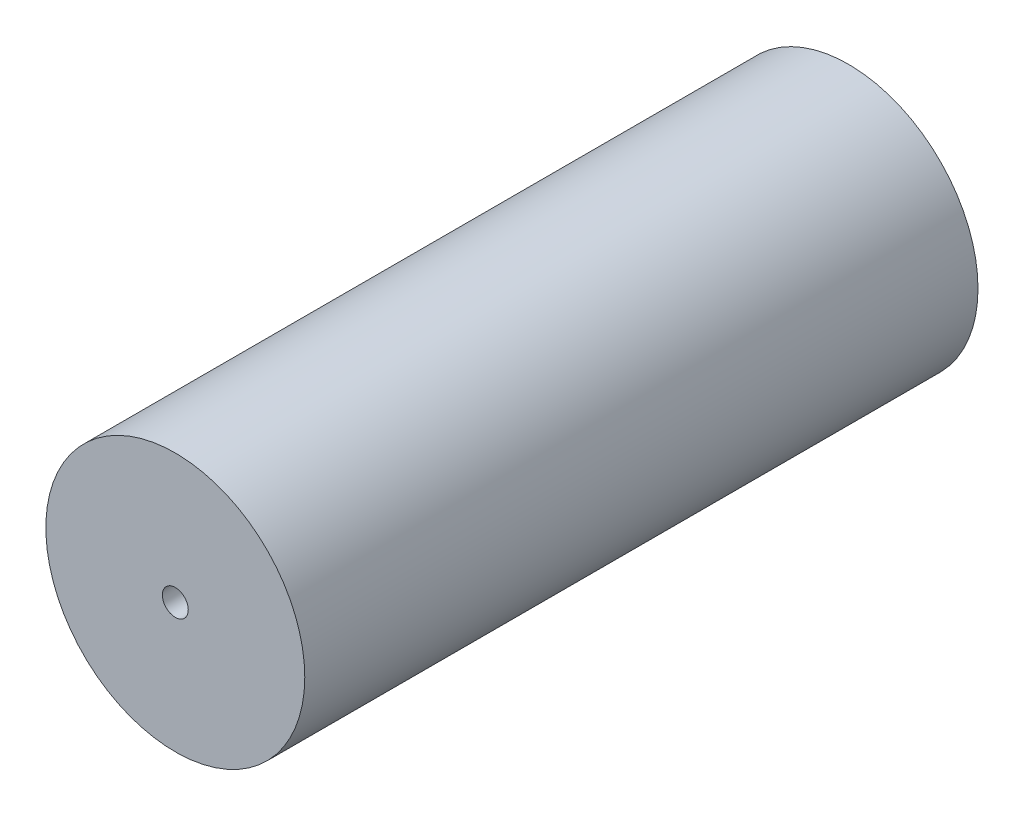
ISO-10303-21;
HEADER;
FILE_DESCRIPTION(('STEP AP214'),'2;1');
FILE_NAME('part.step','',(''),(''),'','','');
FILE_SCHEMA(('AUTOMOTIVE_DESIGN { 1 0 10303 214 1 1 1 1 }'));
ENDSEC;
DATA;
#1=APPLICATION_CONTEXT('core data for automotive mechanical design processes');
#2=APPLICATION_PROTOCOL_DEFINITION('international standard','automotive_design',2000,#1);
#3=PRODUCT_CONTEXT('',#1,'mechanical');
#4=PRODUCT('Part','Part','',(#3));
#5=PRODUCT_RELATED_PRODUCT_CATEGORY('part','',(#4));
#6=PRODUCT_DEFINITION_FORMATION('','',#4);
#7=PRODUCT_DEFINITION_CONTEXT('part definition',#1,'design');
#8=PRODUCT_DEFINITION('design','',#6,#7);
#9=PRODUCT_DEFINITION_SHAPE('','',#8);
#10=(LENGTH_UNIT() NAMED_UNIT(*) SI_UNIT(.MILLI.,.METRE.));
#11=(NAMED_UNIT(*) PLANE_ANGLE_UNIT() SI_UNIT($,.RADIAN.));
#12=(NAMED_UNIT(*) SI_UNIT($,.STERADIAN.) SOLID_ANGLE_UNIT());
#13=UNCERTAINTY_MEASURE_WITH_UNIT(LENGTH_MEASURE(1.E-05),#10,'distance_accuracy_value','');
#14=(GEOMETRIC_REPRESENTATION_CONTEXT(3) GLOBAL_UNCERTAINTY_ASSIGNED_CONTEXT((#13)) GLOBAL_UNIT_ASSIGNED_CONTEXT((#10,
#11,#12)) REPRESENTATION_CONTEXT('',''));
#15=CARTESIAN_POINT('',(0.,0.,0.));
#16=DIRECTION('',(0.,0.,1.));
#17=DIRECTION('',(1.,0.,0.));
#18=AXIS2_PLACEMENT_3D('',#15,#16,#17);
#19=CARTESIAN_POINT('',(0.,0.,26.));
#20=DIRECTION('',(0.,0.,1.));
#21=DIRECTION('',(1.,0.,0.));
#22=AXIS2_PLACEMENT_3D('',#19,#20,#21);
#23=PLANE('',#22);
#24=CARTESIAN_POINT('',(0.,0.,26.));
#25=DIRECTION('',(0.,0.,1.));
#26=DIRECTION('',(1.,0.,0.));
#27=AXIS2_PLACEMENT_3D('',#24,#25,#26);
#28=CIRCLE('',#27,5.);
#29=CARTESIAN_POINT('',(5.,0.,26.));
#30=VERTEX_POINT('',#29);
#31=EDGE_CURVE('E10',#30,#30,#28,.T.);
#32=ORIENTED_EDGE('',*,*,#31,.T.);
#33=EDGE_LOOP('',(#32));
#34=FACE_BOUND('',#33,.T.);
#35=CARTESIAN_POINT('',(0.,0.,26.));
#36=DIRECTION('',(0.,0.,1.));
#37=DIRECTION('',(1.,0.,0.));
#38=AXIS2_PLACEMENT_3D('',#35,#36,#37);
#39=CIRCLE('',#38,0.5);
#40=CARTESIAN_POINT('',(0.5,0.,26.));
#41=VERTEX_POINT('',#40);
#42=EDGE_CURVE('E41',#41,#41,#39,.T.);
#43=ORIENTED_EDGE('',*,*,#42,.F.);
#44=EDGE_LOOP('',(#43));
#45=FACE_BOUND('',#44,.T.);
#46=ADVANCED_FACE('F30',(#34,#45),#23,.T.);
#47=CARTESIAN_POINT('',(0.,0.,0.));
#48=DIRECTION('',(0.,0.,1.));
#49=DIRECTION('',(1.,0.,0.));
#50=AXIS2_PLACEMENT_3D('',#47,#48,#49);
#51=PLANE('',#50);
#52=CARTESIAN_POINT('',(0.,0.,0.));
#53=DIRECTION('',(0.,0.,1.));
#54=DIRECTION('',(1.,0.,0.));
#55=AXIS2_PLACEMENT_3D('',#52,#53,#54);
#56=CIRCLE('',#55,5.);
#57=CARTESIAN_POINT('',(5.,0.,0.));
#58=VERTEX_POINT('',#57);
#59=EDGE_CURVE('E34',#58,#58,#56,.T.);
#60=ORIENTED_EDGE('',*,*,#59,.F.);
#61=EDGE_LOOP('',(#60));
#62=FACE_BOUND('',#61,.T.);
#63=CARTESIAN_POINT('',(0.,0.,0.));
#64=DIRECTION('',(0.,0.,1.));
#65=DIRECTION('',(1.,0.,0.));
#66=AXIS2_PLACEMENT_3D('',#63,#64,#65);
#67=CIRCLE('',#66,0.5);
#68=CARTESIAN_POINT('',(0.5,0.,0.));
#69=VERTEX_POINT('',#68);
#70=EDGE_CURVE('E43',#69,#69,#67,.T.);
#71=ORIENTED_EDGE('',*,*,#70,.T.);
#72=EDGE_LOOP('',(#71));
#73=FACE_BOUND('',#72,.T.);
#74=ADVANCED_FACE('F53',(#62,#73),#51,.F.);
#75=CARTESIAN_POINT('',(0.,0.,26.));
#76=DIRECTION('',(0.,0.,-1.));
#77=DIRECTION('',(-1.,0.,0.));
#78=AXIS2_PLACEMENT_3D('',#75,#76,#77);
#79=CYLINDRICAL_SURFACE('',#78,5.);
#80=ORIENTED_EDGE('',*,*,#31,.F.);
#81=EDGE_LOOP('',(#80));
#82=FACE_BOUND('',#81,.T.);
#83=ORIENTED_EDGE('',*,*,#59,.T.);
#84=EDGE_LOOP('',(#83));
#85=FACE_BOUND('',#84,.T.);
#86=ADVANCED_FACE('F32',(#82,#85),#79,.T.);
#87=CARTESIAN_POINT('',(0.,0.,26.));
#88=DIRECTION('',(0.,0.,-1.));
#89=DIRECTION('',(-1.,0.,0.));
#90=AXIS2_PLACEMENT_3D('',#87,#88,#89);
#91=CYLINDRICAL_SURFACE('',#90,0.5);
#92=ORIENTED_EDGE('',*,*,#42,.T.);
#93=EDGE_LOOP('',(#92));
#94=FACE_BOUND('',#93,.T.);
#95=ORIENTED_EDGE('',*,*,#70,.F.);
#96=EDGE_LOOP('',(#95));
#97=FACE_BOUND('',#96,.T.);
#98=ADVANCED_FACE('F49',(#94,#97),#91,.F.);
#99=CLOSED_SHELL('',(#46,#74,#86,#98));
#100=MANIFOLD_SOLID_BREP('B2',#99);
#101=ADVANCED_BREP_SHAPE_REPRESENTATION('',(#18,#100),#14);
#102=SHAPE_DEFINITION_REPRESENTATION(#9,#101);
ENDSEC;
END-ISO-10303-21;
